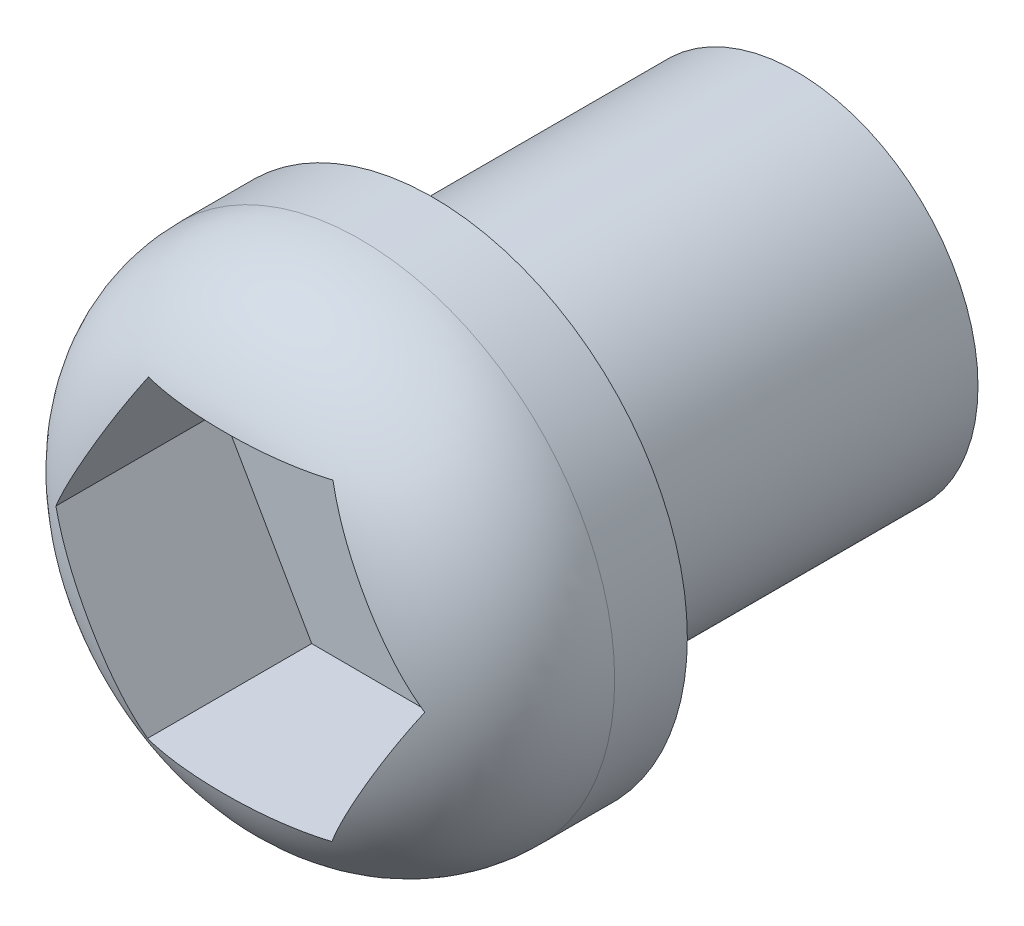
ISO-10303-21;
HEADER;
FILE_DESCRIPTION(('STEP AP214'),'2;1');
FILE_NAME('part.step','',(''),(''),'','','');
FILE_SCHEMA(('AUTOMOTIVE_DESIGN { 1 0 10303 214 1 1 1 1 }'));
ENDSEC;
DATA;
#1=APPLICATION_CONTEXT('core data for automotive mechanical design processes');
#2=APPLICATION_PROTOCOL_DEFINITION('international standard','automotive_design',2000,#1);
#3=PRODUCT_CONTEXT('',#1,'mechanical');
#4=PRODUCT('Part','Part','',(#3));
#5=PRODUCT_RELATED_PRODUCT_CATEGORY('part','',(#4));
#6=PRODUCT_DEFINITION_FORMATION('','',#4);
#7=PRODUCT_DEFINITION_CONTEXT('part definition',#1,'design');
#8=PRODUCT_DEFINITION('design','',#6,#7);
#9=PRODUCT_DEFINITION_SHAPE('','',#8);
#10=(LENGTH_UNIT() NAMED_UNIT(*) SI_UNIT(.MILLI.,.METRE.));
#11=(NAMED_UNIT(*) PLANE_ANGLE_UNIT() SI_UNIT($,.RADIAN.));
#12=(NAMED_UNIT(*) SI_UNIT($,.STERADIAN.) SOLID_ANGLE_UNIT());
#13=UNCERTAINTY_MEASURE_WITH_UNIT(LENGTH_MEASURE(1.E-05),#10,'distance_accuracy_value','');
#14=(GEOMETRIC_REPRESENTATION_CONTEXT(3) GLOBAL_UNCERTAINTY_ASSIGNED_CONTEXT((#13)) GLOBAL_UNIT_ASSIGNED_CONTEXT((#10,
#11,#12)) REPRESENTATION_CONTEXT('',''));
#15=CARTESIAN_POINT('',(0.,0.,0.));
#16=DIRECTION('',(0.,0.,1.));
#17=DIRECTION('',(1.,0.,0.));
#18=AXIS2_PLACEMENT_3D('',#15,#16,#17);
#19=CARTESIAN_POINT('',(-3.18416219575714,-0.34894928172681,3.));
#20=DIRECTION('',(0.,0.,-1.));
#21=DIRECTION('',(-1.,0.,0.));
#22=AXIS2_PLACEMENT_3D('',#19,#20,#21);
#23=CYLINDRICAL_SURFACE('',#22,3.5);
#24=CARTESIAN_POINT('',(-3.18416219575714,-0.34894928172681,1.));
#25=DIRECTION('',(0.,0.,1.));
#26=DIRECTION('',(1.,0.,0.));
#27=AXIS2_PLACEMENT_3D('',#24,#25,#26);
#28=CIRCLE('',#27,3.5);
#29=CARTESIAN_POINT('',(0.315837804242859,-0.34894928172681,1.));
#30=VERTEX_POINT('',#29);
#31=EDGE_CURVE('E11',#30,#30,#28,.F.);
#32=ORIENTED_EDGE('',*,*,#31,.T.);
#33=EDGE_LOOP('',(#32));
#34=FACE_BOUND('',#33,.T.);
#35=CARTESIAN_POINT('',(-3.18416219575714,-0.34894928172681,0.));
#36=DIRECTION('',(0.,0.,1.));
#37=DIRECTION('',(1.,0.,0.));
#38=AXIS2_PLACEMENT_3D('',#35,#36,#37);
#39=CIRCLE('',#38,3.5);
#40=CARTESIAN_POINT('',(0.315837804242859,-0.34894928172681,0.));
#41=VERTEX_POINT('',#40);
#42=EDGE_CURVE('E158',#41,#41,#39,.T.);
#43=ORIENTED_EDGE('',*,*,#42,.T.);
#44=EDGE_LOOP('',(#43));
#45=FACE_BOUND('',#44,.T.);
#46=ADVANCED_FACE('F39',(#34,#45),#23,.T.);
#47=CARTESIAN_POINT('',(-3.18416219575714,-0.34894928172681,0.));
#48=DIRECTION('',(0.,0.,1.));
#49=DIRECTION('',(1.,0.,0.));
#50=AXIS2_PLACEMENT_3D('',#47,#48,#49);
#51=PLANE('',#50);
#52=CARTESIAN_POINT('',(-3.18416219575714,-0.34894928172681,0.));
#53=DIRECTION('',(0.,0.,-1.));
#54=DIRECTION('',(-1.,0.,0.));
#55=AXIS2_PLACEMENT_3D('',#52,#53,#54);
#56=CIRCLE('',#55,2.5);
#57=CARTESIAN_POINT('',(-5.68416219575714,-0.34894928172681,0.));
#58=VERTEX_POINT('',#57);
#59=EDGE_CURVE('E159',#58,#58,#56,.T.);
#60=ORIENTED_EDGE('',*,*,#59,.F.);
#61=EDGE_LOOP('',(#60));
#62=FACE_BOUND('',#61,.T.);
#63=ORIENTED_EDGE('',*,*,#42,.F.);
#64=EDGE_LOOP('',(#63));
#65=FACE_BOUND('',#64,.T.);
#66=ADVANCED_FACE('F250',(#62,#65),#51,.F.);
#67=CARTESIAN_POINT('',(-3.18416219575714,-0.34894928172681,-5.));
#68=DIRECTION('',(0.,0.,1.));
#69=DIRECTION('',(1.,0.,0.));
#70=AXIS2_PLACEMENT_3D('',#67,#68,#69);
#71=CYLINDRICAL_SURFACE('',#70,2.5);
#72=CARTESIAN_POINT('',(-3.18416219575714,-0.34894928172681,-5.));
#73=DIRECTION('',(0.,0.,-1.));
#74=DIRECTION('',(-1.,0.,0.));
#75=AXIS2_PLACEMENT_3D('',#72,#73,#74);
#76=CIRCLE('',#75,2.5);
#77=CARTESIAN_POINT('',(-5.68416219575714,-0.34894928172681,-5.));
#78=VERTEX_POINT('',#77);
#79=EDGE_CURVE('E142',#78,#78,#76,.T.);
#80=ORIENTED_EDGE('',*,*,#79,.F.);
#81=EDGE_LOOP('',(#80));
#82=FACE_BOUND('',#81,.T.);
#83=ORIENTED_EDGE('',*,*,#59,.T.);
#84=EDGE_LOOP('',(#83));
#85=FACE_BOUND('',#84,.T.);
#86=ADVANCED_FACE('F255',(#82,#85),#71,.T.);
#87=CARTESIAN_POINT('',(-3.18416219575714,-0.34894928172681,-5.));
#88=DIRECTION('',(0.,0.,-1.));
#89=DIRECTION('',(-1.,0.,0.));
#90=AXIS2_PLACEMENT_3D('',#87,#88,#89);
#91=PLANE('',#90);
#92=ORIENTED_EDGE('',*,*,#79,.T.);
#93=EDGE_LOOP('',(#92));
#94=FACE_BOUND('',#93,.T.);
#95=ADVANCED_FACE('F192',(#94),#91,.T.);
#96=CARTESIAN_POINT('',(-1.86272757823312,-2.51004547913587,0.5));
#97=DIRECTION('',(0.864480363386056,-0.502666590614408,0.));
#98=DIRECTION('',(0.502666590614408,0.864480363386056,0.));
#99=AXIS2_PLACEMENT_3D('',#96,#97,#98);
#100=PLANE('',#99);
#101=DIRECTION('',(0.,0.,1.));
#102=VECTOR('',#101,1.);
#103=CARTESIAN_POINT('',(-1.86272757823312,-2.51004547913587,0.5));
#104=LINE('',#103,#102);
#105=CARTESIAN_POINT('',(-1.86272757823312,-2.51004547913587,0.5));
#106=VERTEX_POINT('',#105);
#107=CARTESIAN_POINT('',(-1.86272757823312,-2.51004547913587,2.71252231774044));
#108=VERTEX_POINT('',#107);
#109=EDGE_CURVE('E139',#106,#108,#104,.T.);
#110=ORIENTED_EDGE('',*,*,#109,.T.);
#111=CARTESIAN_POINT('',(-1.86272757823312,-2.51004547913587,2.71252231774044));
#112=CARTESIAN_POINT('',(-1.83663045208506,-2.46516393435639,2.72740732762005));
#113=CARTESIAN_POINT('',(-1.81034632447537,-2.41996078656107,2.74092914828199));
#114=CARTESIAN_POINT('',(-1.75749790311798,-2.32907266438934,2.76547362850106));
#115=CARTESIAN_POINT('',(-1.73093375875836,-2.28338794692886,2.7764975564157));
#116=CARTESIAN_POINT('',(-1.6510510510786,-2.14600656242336,2.80613546075439));
#117=CARTESIAN_POINT('',(-1.5974149680534,-2.05376382855169,2.82138539502996));
#118=CARTESIAN_POINT('',(-1.49066758747641,-1.87018088097821,2.84432607177661));
#119=CARTESIAN_POINT('',(-1.43756247496953,-1.77885130424725,2.85213874622076));
#120=CARTESIAN_POINT('',(-1.33116417183729,-1.59586869614714,2.86166973476577));
#121=CARTESIAN_POINT('',(-1.27787084518304,-1.504215430837,2.86338186721763));
#122=CARTESIAN_POINT('',(-1.17314287747577,-1.32410544686214,2.86098179449689));
#123=CARTESIAN_POINT('',(-1.12170712237229,-1.23564681226591,2.85706715844814));
#124=CARTESIAN_POINT('',(-1.01909024807744,-1.05916746305846,2.84325476930116));
#125=CARTESIAN_POINT('',(-0.967908910672159,-0.97114637316542,2.83336361727519));
#126=CARTESIAN_POINT('',(-0.865157052307901,-0.794434879869729,2.80626886225991));
#127=CARTESIAN_POINT('',(-0.813593852791408,-0.705757067801731,2.78894833029508));
#128=CARTESIAN_POINT('',(-0.71129772192173,-0.52982932953865,2.74533674766495));
#129=CARTESIAN_POINT('',(-0.660567514060034,-0.442584087173677,2.71902075908181));
#130=CARTESIAN_POINT('',(-0.610585848219307,-0.356626178978865,2.6874268105888));
#131=B_SPLINE_CURVE_WITH_KNOTS('',3,(#111,#112,#113,#114,#115,#116,#117,#118,#119,#120,#121,
#122,#123,#124,#125,#126,#127,#128,#129,#130),.UNSPECIFIED.,.F.,.F.,(4,2,2,2,2,2,2,2,2,4),(0.,
0.16198018585246,0.323877937623108,0.646888505546771,0.964507247110198,1.28244773878973,
1.58949353193591,1.89620081081297,2.20792339132846,2.52051725846487),.UNSPECIFIED.);
#132=CARTESIAN_POINT('',(-0.610585848219307,-0.356626178978865,2.68742681058879));
#133=VERTEX_POINT('',#132);
#134=EDGE_CURVE('E49',#108,#133,#131,.T.);
#135=ORIENTED_EDGE('',*,*,#134,.T.);
#136=DIRECTION('',(0.,0.,1.));
#137=VECTOR('',#136,1.);
#138=CARTESIAN_POINT('',(-0.610585848219307,-0.356626178978865,0.5));
#139=LINE('',#138,#137);
#140=CARTESIAN_POINT('',(-0.610585848219307,-0.356626178978865,0.5));
#141=VERTEX_POINT('',#140);
#142=EDGE_CURVE('E98',#141,#133,#139,.T.);
#143=ORIENTED_EDGE('',*,*,#142,.F.);
#144=DIRECTION('',(0.502666590614408,0.864480363386056,0.));
#145=VECTOR('',#144,1.);
#146=CARTESIAN_POINT('',(-1.86272757823312,-2.51004547913587,0.5));
#147=LINE('',#146,#145);
#148=EDGE_CURVE('E102',#106,#141,#147,.T.);
#149=ORIENTED_EDGE('',*,*,#148,.F.);
#150=EDGE_LOOP('',(#110,#135,#143,#149));
#151=FACE_BOUND('',#150,.T.);
#152=ADVANCED_FACE('F100',(#151),#100,.F.);
#153=CARTESIAN_POINT('',(-4.3537142621757,-2.50236858188382,0.5));
#154=DIRECTION('',(-0.00308185541276203,-0.999995251072331,0.));
#155=DIRECTION('',(0.999995251072331,-0.00308185541276203,0.));
#156=AXIS2_PLACEMENT_3D('',#153,#154,#155);
#157=PLANE('',#156);
#158=DIRECTION('',(0.,0.,1.));
#159=VECTOR('',#158,1.);
#160=CARTESIAN_POINT('',(-4.3537142621757,-2.50236858188382,0.5));
#161=LINE('',#160,#159);
#162=CARTESIAN_POINT('',(-4.3537142621757,-2.50236858188382,0.5));
#163=VERTEX_POINT('',#162);
#164=CARTESIAN_POINT('',(-4.3537142621757,-2.50236858188382,2.75968877188747));
#165=VERTEX_POINT('',#164);
#166=EDGE_CURVE('E143',#163,#165,#161,.T.);
#167=ORIENTED_EDGE('',*,*,#166,.T.);
#168=CARTESIAN_POINT('',(-4.3537142621757,-2.50236858188382,2.75968877188747));
#169=CARTESIAN_POINT('',(-4.28755125845209,-2.5025724876633,2.77664190746429));
#170=CARTESIAN_POINT('',(-4.2208918056826,-2.50277792343423,2.79152916953616));
#171=CARTESIAN_POINT('',(-4.08690963924768,-2.50319083905998,2.81763260366835));
#172=CARTESIAN_POINT('',(-4.01958751085046,-2.50339831711107,2.82885175982737));
#173=CARTESIAN_POINT('',(-3.88457300022771,-2.50381441428745,2.84809546393809));
#174=CARTESIAN_POINT('',(-3.8168810906076,-2.50402303195623,2.85612341330951));
#175=CARTESIAN_POINT('',(-3.68121404762049,-2.50444114015256,2.86941002610678));
#176=CARTESIAN_POINT('',(-3.6132388516319,-2.5046506308731,2.87466804048734));
#177=CARTESIAN_POINT('',(-3.47850138778359,-2.50506587422733,2.88264356670066));
#178=CARTESIAN_POINT('',(-3.41174192013622,-2.50527161823111,2.88540958138203));
#179=CARTESIAN_POINT('',(-3.27816790601853,-2.50568327598446,2.88875248421294));
#180=CARTESIAN_POINT('',(-3.21135335844276,-2.50588918973743,2.88932932730009));
#181=CARTESIAN_POINT('',(-3.07771249300511,-2.50630105351785,2.88833176254756));
#182=CARTESIAN_POINT('',(-3.0108861815073,-2.5065070035257,2.88675647468399));
#183=CARTESIAN_POINT('',(-2.87732854108975,-2.50691861081743,2.88135041677014));
#184=CARTESIAN_POINT('',(-2.81059720549468,-2.50712426812188,2.87751981396741));
#185=CARTESIAN_POINT('',(-2.66977326239462,-2.50755826921421,2.86679753157719));
#186=CARTESIAN_POINT('',(-2.59570255860145,-2.50778654549769,2.85960839934621));
#187=CARTESIAN_POINT('',(-2.44804956552198,-2.50824159283461,2.84168445540317));
#188=CARTESIAN_POINT('',(-2.37446690982515,-2.50846836501728,2.83095270970084));
#189=CARTESIAN_POINT('',(-2.22720277536219,-2.50892221394248,2.80522074315856));
#190=CARTESIAN_POINT('',(-2.15352900649709,-2.50914926692409,2.79017515130813));
#191=CARTESIAN_POINT('',(-2.00720584590875,-2.50960021589009,2.75518797358299));
#192=CARTESIAN_POINT('',(-1.93455879875479,-2.50982410464881,2.73523665179705));
#193=CARTESIAN_POINT('',(-1.86272757823312,-2.51004547913587,2.71252231774044));
#194=B_SPLINE_CURVE_WITH_KNOTS('',3,(#168,#169,#170,#171,#172,#173,#174,#175,#176,#177,#178,
#179,#180,#181,#182,#183,#184,#185,#186,#187,#188,#189,#190,#191,#192,#193),.UNSPECIFIED.,.F.,
.F.,(4,2,2,2,2,2,2,2,2,2,2,2,4),(0.,0.204823172740069,0.409479299522327,0.613916700261906,
0.81840198305677,1.01881545839749,1.21923305907026,1.41973263666539,1.62021734767162,
1.84339921403549,2.06638842840248,2.29181483993211,2.51769229566954),.UNSPECIFIED.);
#195=EDGE_CURVE('E56',#165,#108,#194,.T.);
#196=ORIENTED_EDGE('',*,*,#195,.T.);
#197=ORIENTED_EDGE('',*,*,#109,.F.);
#198=DIRECTION('',(0.999995251072331,-0.00308185541276203,0.));
#199=VECTOR('',#198,1.);
#200=CARTESIAN_POINT('',(-4.3537142621757,-2.50236858188382,0.5));
#201=LINE('',#200,#199);
#202=EDGE_CURVE('E109',#163,#106,#201,.T.);
#203=ORIENTED_EDGE('',*,*,#202,.F.);
#204=EDGE_LOOP('',(#167,#196,#197,#203));
#205=FACE_BOUND('',#204,.T.);
#206=ADVANCED_FACE('F191',(#205),#157,.F.);
#207=CARTESIAN_POINT('',(-5.59255921610447,-0.341272384474755,0.5));
#208=DIRECTION('',(-0.867562218798818,-0.497328660457923,0.));
#209=DIRECTION('',(0.497328660457923,-0.867562218798818,0.));
#210=AXIS2_PLACEMENT_3D('',#207,#208,#209);
#211=PLANE('',#210);
#212=DIRECTION('',(0.,0.,1.));
#213=VECTOR('',#212,1.);
#214=CARTESIAN_POINT('',(-5.59255921610447,-0.341272384474755,0.5));
#215=LINE('',#214,#213);
#216=CARTESIAN_POINT('',(-5.59255921610447,-0.341272384474755,0.5));
#217=VERTEX_POINT('',#216);
#218=CARTESIAN_POINT('',(-5.59255921610447,-0.341272384474755,2.78179477616654));
#219=VERTEX_POINT('',#218);
#220=EDGE_CURVE('E146',#217,#219,#215,.T.);
#221=ORIENTED_EDGE('',*,*,#220,.T.);
#222=CARTESIAN_POINT('',(-5.59255921610447,-0.341272384474755,2.78179477616654));
#223=CARTESIAN_POINT('',(-5.55871155934989,-0.400317741257745,2.79914121071566));
#224=CARTESIAN_POINT('',(-5.52460558645963,-0.459813716188537,2.81429995840612));
#225=CARTESIAN_POINT('',(-5.45605645681498,-0.579393864568641,2.84077072825982));
#226=CARTESIAN_POINT('',(-5.42161364206523,-0.639477441409883,2.85208630452175));
#227=CARTESIAN_POINT('',(-5.35254776409673,-0.7599590285327,2.87141811987511));
#228=CARTESIAN_POINT('',(-5.31792496180694,-0.820356583638226,2.87943823990148));
#229=CARTESIAN_POINT('',(-5.24854027968593,-0.941394306893769,2.89267880037915));
#230=CARTESIAN_POINT('',(-5.21377836542985,-1.00203453509603,2.89789849833606));
#231=CARTESIAN_POINT('',(-5.14481039609091,-1.12234532605397,2.90583699561133));
#232=CARTESIAN_POINT('',(-5.11060553203777,-1.18201381112444,2.90859889812676));
#233=CARTESIAN_POINT('',(-5.04216950896847,-1.30139665136755,2.91199494687737));
#234=CARTESIAN_POINT('',(-5.00793834934984,-1.36111100759116,2.91262904281254));
#235=CARTESIAN_POINT('',(-4.93946777486923,-1.48055412085178,2.91182156132954));
#236=CARTESIAN_POINT('',(-4.90522836243653,-1.54028287365106,2.91037912655982));
#237=CARTESIAN_POINT('',(-4.8367915244793,-1.65966713542087,2.90529969772383));
#238=CARTESIAN_POINT('',(-4.80259409589309,-1.71932264973239,2.90166287454478));
#239=CARTESIAN_POINT('',(-4.73359336823472,-1.83969058575865,2.89182357593376));
#240=CARTESIAN_POINT('',(-4.69879179627458,-1.90039999462244,2.88557072159896));
#241=CARTESIAN_POINT('',(-4.62937798368606,-2.0214885343602,2.87008094819527));
#242=CARTESIAN_POINT('',(-4.59476561667499,-2.08186788570173,2.86084635778636));
#243=CARTESIAN_POINT('',(-4.52550062405537,-2.20269681727151,2.83878334465855));
#244=CARTESIAN_POINT('',(-4.49085040392234,-2.26314220128135,2.82592353681559));
#245=CARTESIAN_POINT('',(-4.42193455847635,-2.38336206500379,2.79605948795148));
#246=CARTESIAN_POINT('',(-4.38766970795585,-2.443135193134,2.7790480689482));
#247=CARTESIAN_POINT('',(-4.3537142621757,-2.50236858188382,2.75968877188747));
#248=B_SPLINE_CURVE_WITH_KNOTS('',3,(#222,#223,#224,#225,#226,#227,#228,#229,#230,#231,#232,
#233,#234,#235,#236,#237,#238,#239,#240,#241,#242,#243,#244,#245,#246,#247),.UNSPECIFIED.,.F.,
.F.,(4,2,2,2,2,2,2,2,2,2,2,2,4),(0.,0.210614811905059,0.421034317115812,0.631205304014374,
0.841431987431326,1.04789474516216,1.25436238350923,1.46091529202555,1.66745211738258,
1.87816412023997,2.0887119588052,2.30114174655774,2.51394145245556),.UNSPECIFIED.);
#249=EDGE_CURVE('E64',#219,#165,#248,.T.);
#250=ORIENTED_EDGE('',*,*,#249,.T.);
#251=ORIENTED_EDGE('',*,*,#166,.F.);
#252=DIRECTION('',(0.497328660457923,-0.867562218798818,0.));
#253=VECTOR('',#252,1.);
#254=CARTESIAN_POINT('',(-5.59255921610447,-0.341272384474755,0.5));
#255=LINE('',#254,#253);
#256=EDGE_CURVE('E134',#217,#163,#255,.T.);
#257=ORIENTED_EDGE('',*,*,#256,.F.);
#258=EDGE_LOOP('',(#221,#250,#251,#257));
#259=FACE_BOUND('',#258,.T.);
#260=ADVANCED_FACE('F216',(#259),#211,.F.);
#261=CARTESIAN_POINT('',(-4.34041748609066,1.81214691568225,0.5));
#262=DIRECTION('',(-0.864480363386056,0.502666590614408,0.));
#263=DIRECTION('',(-0.502666590614408,-0.864480363386056,0.));
#264=AXIS2_PLACEMENT_3D('',#261,#262,#263);
#265=PLANE('',#264);
#266=DIRECTION('',(0.,0.,1.));
#267=VECTOR('',#266,1.);
#268=CARTESIAN_POINT('',(-4.34041748609066,1.81214691568225,0.5));
#269=LINE('',#268,#267);
#270=CARTESIAN_POINT('',(-4.34041748609066,1.81214691568225,0.5));
#271=VERTEX_POINT('',#270);
#272=CARTESIAN_POINT('',(-4.34041748609066,1.81214691568225,2.75944665070847));
#273=VERTEX_POINT('',#272);
#274=EDGE_CURVE('E149',#271,#273,#269,.T.);
#275=ORIENTED_EDGE('',*,*,#274,.T.);
#276=CARTESIAN_POINT('',(-4.34041748609066,1.81214691568225,2.75944665070847));
#277=CARTESIAN_POINT('',(-4.37265730068183,1.75670124422991,2.77764754972315));
#278=CARTESIAN_POINT('',(-4.40517552662204,1.70077676406285,2.79377534862854));
#279=CARTESIAN_POINT('',(-4.47058975839274,1.58827810211153,2.82233837811341));
#280=CARTESIAN_POINT('',(-4.5034853817591,1.53170457808478,2.83477705392183));
#281=CARTESIAN_POINT('',(-4.56946006390962,1.41824205985765,2.8564227979775));
#282=CARTESIAN_POINT('',(-4.60253852366105,1.36135409586701,2.86563726261706));
#283=CARTESIAN_POINT('',(-4.66886604145016,1.24728477486691,2.88131634671573));
#284=CARTESIAN_POINT('',(-4.70211514188158,1.19010334494914,2.88778024566452));
#285=CARTESIAN_POINT('',(-4.76816361986355,1.07651391347895,2.89824445693196));
#286=CARTESIAN_POINT('',(-4.80096149528005,1.0201084952798,2.90228320357118));
#287=CARTESIAN_POINT('',(-4.86660488090972,0.907215737092579,2.90832406600834));
#288=CARTESIAN_POINT('',(-4.89945039299238,0.850728393889393,2.91032609958479));
#289=CARTESIAN_POINT('',(-4.96518178501495,0.737684283294951,2.91243825357428));
#290=CARTESIAN_POINT('',(-4.99806767656364,0.68112749593906,2.91254691595756));
#291=CARTESIAN_POINT('',(-5.06382576024891,0.568037481322566,2.91087606974586));
#292=CARTESIAN_POINT('',(-5.09669795294961,0.511504253091773,2.90909664863446));
#293=CARTESIAN_POINT('',(-5.16834004767803,0.388294982292889,2.90301945974437));
#294=CARTESIAN_POINT('',(-5.20710189472348,0.321632792592934,2.89832460012536));
#295=CARTESIAN_POINT('',(-5.28446074771438,0.188591905067548,2.88570281488725));
#296=CARTESIAN_POINT('',(-5.32305786845867,0.122213009812353,2.87777872894225));
#297=CARTESIAN_POINT('',(-5.40039371283079,-0.0107883077485735,2.85799322372579));
#298=CARTESIAN_POINT('',(-5.43913006563364,-0.0774066527361135,2.84609366355434));
#299=CARTESIAN_POINT('',(-5.5162033252718,-0.209956380017378,2.817630050651));
#300=CARTESIAN_POINT('',(-5.55453979307911,-0.275887007275692,2.80106133709847));
#301=CARTESIAN_POINT('',(-5.59255921610447,-0.341272384474755,2.78179477616654));
#302=B_SPLINE_CURVE_WITH_KNOTS('',3,(#276,#277,#278,#279,#280,#281,#282,#283,#284,#285,#286,
#287,#288,#289,#290,#291,#292,#293,#294,#295,#296,#297,#298,#299,#300,#301),.UNSPECIFIED.,.F.,
.F.,(4,2,2,2,2,2,2,2,2,2,2,2,4),(0.,0.199927930055445,0.399668557548234,0.598947925596882,
0.798279462761793,0.994362315982469,1.19045308469225,1.38669485049705,1.58292752391711,
1.81463295456642,2.04613506934173,2.27992525480615,2.51394964495157),.UNSPECIFIED.);
#303=EDGE_CURVE('E223',#273,#219,#302,.T.);
#304=ORIENTED_EDGE('',*,*,#303,.T.);
#305=ORIENTED_EDGE('',*,*,#220,.F.);
#306=DIRECTION('',(-0.502666590614408,-0.864480363386056,0.));
#307=VECTOR('',#306,1.);
#308=CARTESIAN_POINT('',(-4.34041748609066,1.81214691568225,0.5));
#309=LINE('',#308,#307);
#310=EDGE_CURVE('E130',#271,#217,#309,.T.);
#311=ORIENTED_EDGE('',*,*,#310,.F.);
#312=EDGE_LOOP('',(#275,#304,#305,#311));
#313=FACE_BOUND('',#312,.T.);
#314=ADVANCED_FACE('F219',(#313),#265,.F.);
#315=CARTESIAN_POINT('',(-1.84943080214808,1.8044700184302,0.5));
#316=DIRECTION('',(0.00308185541276177,0.999995251072331,0.));
#317=DIRECTION('',(-0.999995251072331,0.00308185541276178,0.));
#318=AXIS2_PLACEMENT_3D('',#315,#316,#317);
#319=PLANE('',#318);
#320=DIRECTION('',(0.,0.,1.));
#321=VECTOR('',#320,1.);
#322=CARTESIAN_POINT('',(-1.84943080214808,1.8044700184302,0.5));
#323=LINE('',#322,#321);
#324=CARTESIAN_POINT('',(-1.84943080214808,1.8044700184302,0.5));
#325=VERTEX_POINT('',#324);
#326=CARTESIAN_POINT('',(-1.84943080214808,1.8044700184302,2.71226073472118));
#327=VERTEX_POINT('',#326);
#328=EDGE_CURVE('E108',#325,#327,#323,.T.);
#329=ORIENTED_EDGE('',*,*,#328,.T.);
#330=CARTESIAN_POINT('',(-1.84943080214808,1.8044700184302,2.71226073472118));
#331=CARTESIAN_POINT('',(-1.94791598733855,1.80477353697264,2.74339190785775));
#332=CARTESIAN_POINT('',(-2.0478502451768,1.80508152136868,2.76934423061989));
#333=CARTESIAN_POINT('',(-2.24931871678036,1.805702421017,2.81246456447295));
#334=CARTESIAN_POINT('',(-2.35084743443369,1.80601531933098,2.82965789434493));
#335=CARTESIAN_POINT('',(-2.55335223921952,1.80663941282349,2.85680273110157));
#336=CARTESIAN_POINT('',(-2.65431591283174,1.80695056974517,2.86685298995604));
#337=CARTESIAN_POINT('',(-2.85674494897969,1.80757442972859,2.8813378659138));
#338=CARTESIAN_POINT('',(-2.95821074413915,1.80788713412362,2.88576623429806));
#339=CARTESIAN_POINT('',(-3.16647887556711,1.80852898943989,2.88974303453439));
#340=CARTESIAN_POINT('',(-3.27328606722085,1.8088581553248,2.88902750613074));
#341=CARTESIAN_POINT('',(-3.48661912546052,1.80951562008731,2.88197344699642));
#342=CARTESIAN_POINT('',(-3.59314516240243,1.80984391948993,2.87564022253769));
#343=CARTESIAN_POINT('',(-3.80724988803749,1.81050376243107,2.85622034367967));
#344=CARTESIAN_POINT('',(-3.91482014750884,1.81083527999183,2.84303304970748));
#345=CARTESIAN_POINT('',(-4.07524811949423,1.8113296981536,2.81687509185888));
#346=CARTESIAN_POINT('',(-4.12862605888758,1.81149420202626,2.80707905233799));
#347=CARTESIAN_POINT('',(-4.23491483491809,1.81182177022158,2.78510842528611));
#348=CARTESIAN_POINT('',(-4.28782543499527,1.8119848338152,2.77293269806964));
#349=CARTESIAN_POINT('',(-4.34041748609066,1.81214691568225,2.75944665070848));
#350=B_SPLINE_CURVE_WITH_KNOTS('',3,(#330,#331,#332,#333,#334,#335,#336,#337,#338,#339,#340,
#341,#342,#343,#344,#345,#346,#347,#348,#349),.UNSPECIFIED.,.F.,.F.,(4,2,2,2,2,2,2,2,2,4),(0.,
0.30946937903052,0.618039055264965,0.922255137452662,1.2268090599513,1.54709877730638,
1.86708628238971,2.19191080765515,2.3546711489751,2.51750963170829),.UNSPECIFIED.);
#351=EDGE_CURVE('E229',#327,#273,#350,.T.);
#352=ORIENTED_EDGE('',*,*,#351,.T.);
#353=ORIENTED_EDGE('',*,*,#274,.F.);
#354=DIRECTION('',(-0.999995251072331,0.00308185541276177,0.));
#355=VECTOR('',#354,1.);
#356=CARTESIAN_POINT('',(-1.84943080214808,1.8044700184302,0.5));
#357=LINE('',#356,#355);
#358=EDGE_CURVE('E120',#325,#271,#357,.T.);
#359=ORIENTED_EDGE('',*,*,#358,.F.);
#360=EDGE_LOOP('',(#329,#352,#353,#359));
#361=FACE_BOUND('',#360,.T.);
#362=ADVANCED_FACE('F184',(#361),#319,.F.);
#363=CARTESIAN_POINT('',(-0.610585848219307,-0.356626178978865,0.5));
#364=DIRECTION('',(0.867562218798818,0.497328660457923,0.));
#365=DIRECTION('',(-0.497328660457923,0.867562218798818,0.));
#366=AXIS2_PLACEMENT_3D('',#363,#364,#365);
#367=PLANE('',#366);
#368=CARTESIAN_POINT('',(-0.610585848219307,-0.356626178978865,2.68742681058879));
#369=CARTESIAN_POINT('',(-0.660718063013303,-0.269173315393784,2.71944330748156));
#370=CARTESIAN_POINT('',(-0.711607036848865,-0.18040032770286,2.7460369064056));
#371=CARTESIAN_POINT('',(-0.814092004983389,-0.00162099440152467,2.78992178798913));
#372=CARTESIAN_POINT('',(-0.865682651485097,0.0883760222736782,2.8072628569161));
#373=CARTESIAN_POINT('',(-0.969238033993833,0.26902263398336,2.83447618149559));
#374=CARTESIAN_POINT('',(-1.02120203877468,0.359670953434389,2.84436035125495));
#375=CARTESIAN_POINT('',(-1.09943230597451,0.496139308438539,2.85451301127264));
#376=CARTESIAN_POINT('',(-1.12562970120013,0.541839208998787,2.85711897414534));
#377=CARTESIAN_POINT('',(-1.17804724677262,0.633278705164127,2.86082149099685));
#378=CARTESIAN_POINT('',(-1.20426739328592,0.679018294081777,2.8619182629533));
#379=CARTESIAN_POINT('',(-1.23049078014368,0.724763535600319,2.86229698528138));
#380=B_SPLINE_CURVE_WITH_KNOTS('',3,(#368,#369,#370,#371,#372,#373,#374,#375,#376,#377,#378,
#379),.UNSPECIFIED.,.F.,.F.,(4,2,2,2,2,4),(0.,0.316869412328754,0.632016156606096,
0.946658309053833,1.10486189363376,1.26304262592472),.UNSPECIFIED.);
#381=CARTESIAN_POINT('',(-1.23049078014368,0.72476353560032,2.86229698528138));
#382=VERTEX_POINT('',#381);
#383=EDGE_CURVE('E163',#133,#382,#380,.T.);
#384=ORIENTED_EDGE('',*,*,#383,.T.);
#385=CARTESIAN_POINT('',(-1.23049078014368,0.72476353560032,2.86229698528138));
#386=CARTESIAN_POINT('',(-1.25659473088018,0.770300427440649,2.86265976352829));
#387=CARTESIAN_POINT('',(-1.28270010016023,0.8158397938514,2.86231074174309));
#388=CARTESIAN_POINT('',(-1.33489838095461,0.906896794792707,2.86014322499467));
#389=CARTESIAN_POINT('',(-1.36099129087239,0.952414426538181,2.85832457568603));
#390=CARTESIAN_POINT('',(-1.43895856212791,1.08842399972836,2.85062131081586));
#391=CARTESIAN_POINT('',(-1.49078372283848,1.17883011341235,2.84249386164943));
#392=CARTESIAN_POINT('',(-1.5941355434706,1.35912162273728,2.81921581777538));
#393=CARTESIAN_POINT('',(-1.64566169236392,1.44900612691785,2.80405554024248));
#394=CARTESIAN_POINT('',(-1.72247254725171,1.58299839599988,2.77486903498169));
#395=CARTESIAN_POINT('',(-1.74805861492187,1.62763186960226,2.76403127793865));
#396=CARTESIAN_POINT('',(-1.79896553157932,1.71643615754914,2.7399810913096));
#397=CARTESIAN_POINT('',(-1.82428624378014,1.76060673327724,2.72676749515));
#398=CARTESIAN_POINT('',(-1.84943080214808,1.8044700184302,2.71226073472118));
#399=B_SPLINE_CURVE_WITH_KNOTS('',3,(#385,#386,#387,#388,#389,#390,#391,#392,#393,#394,#395,
#396,#397,#398),.UNSPECIFIED.,.F.,.F.,(4,2,2,2,2,2,4),(0.,0.157459048552398,0.314934636153812,
0.628306045079244,0.942110191346459,1.09978784442268,1.25754313214074),.UNSPECIFIED.);
#400=EDGE_CURVE('E174',#382,#327,#399,.T.);
#401=ORIENTED_EDGE('',*,*,#400,.T.);
#402=ORIENTED_EDGE('',*,*,#328,.F.);
#403=DIRECTION('',(-0.497328660457923,0.867562218798818,0.));
#404=VECTOR('',#403,1.);
#405=CARTESIAN_POINT('',(-0.610585848219307,-0.356626178978865,0.5));
#406=LINE('',#405,#404);
#407=EDGE_CURVE('E112',#141,#325,#406,.T.);
#408=ORIENTED_EDGE('',*,*,#407,.F.);
#409=ORIENTED_EDGE('',*,*,#142,.T.);
#410=EDGE_LOOP('',(#384,#401,#402,#408,#409));
#411=FACE_BOUND('',#410,.T.);
#412=ADVANCED_FACE('F113',(#411),#367,.F.);
#413=CARTESIAN_POINT('',(0.,0.,0.5));
#414=DIRECTION('',(0.,0.,1.));
#415=DIRECTION('',(1.,0.,0.));
#416=AXIS2_PLACEMENT_3D('',#413,#414,#415);
#417=PLANE('',#416);
#418=ORIENTED_EDGE('',*,*,#148,.T.);
#419=ORIENTED_EDGE('',*,*,#407,.T.);
#420=ORIENTED_EDGE('',*,*,#358,.T.);
#421=ORIENTED_EDGE('',*,*,#310,.T.);
#422=ORIENTED_EDGE('',*,*,#256,.T.);
#423=ORIENTED_EDGE('',*,*,#202,.T.);
#424=EDGE_LOOP('',(#418,#419,#420,#421,#422,#423));
#425=FACE_BOUND('',#424,.T.);
#426=ADVANCED_FACE('F122',(#425),#417,.T.);
#427=CARTESIAN_POINT('',(-3.18416219575714,-0.34894928172681,1.));
#428=DIRECTION('',(0.,0.,1.));
#429=DIRECTION('',(1.,0.,0.));
#430=AXIS2_PLACEMENT_3D('',#427,#428,#429);
#431=DEGENERATE_TOROIDAL_SURFACE('',#430,1.5,2.,.T.);
#432=ORIENTED_EDGE('',*,*,#31,.F.);
#433=EDGE_LOOP('',(#432));
#434=FACE_BOUND('',#433,.T.);
#435=ORIENTED_EDGE('',*,*,#351,.F.);
#436=ORIENTED_EDGE('',*,*,#400,.F.);
#437=ORIENTED_EDGE('',*,*,#383,.F.);
#438=ORIENTED_EDGE('',*,*,#134,.F.);
#439=ORIENTED_EDGE('',*,*,#195,.F.);
#440=ORIENTED_EDGE('',*,*,#249,.F.);
#441=ORIENTED_EDGE('',*,*,#303,.F.);
#442=EDGE_LOOP('',(#435,#436,#437,#438,#439,#440,#441));
#443=FACE_BOUND('',#442,.T.);
#444=ADVANCED_FACE('F41',(#434,#443),#431,.T.);
#445=CLOSED_SHELL('',(#46,#66,#86,#95,#152,#206,#260,#314,#362,#412,#426,#444));
#446=MANIFOLD_SOLID_BREP('B2',#445);
#447=ADVANCED_BREP_SHAPE_REPRESENTATION('',(#18,#446),#14);
#448=SHAPE_DEFINITION_REPRESENTATION(#9,#447);
ENDSEC;
END-ISO-10303-21;
